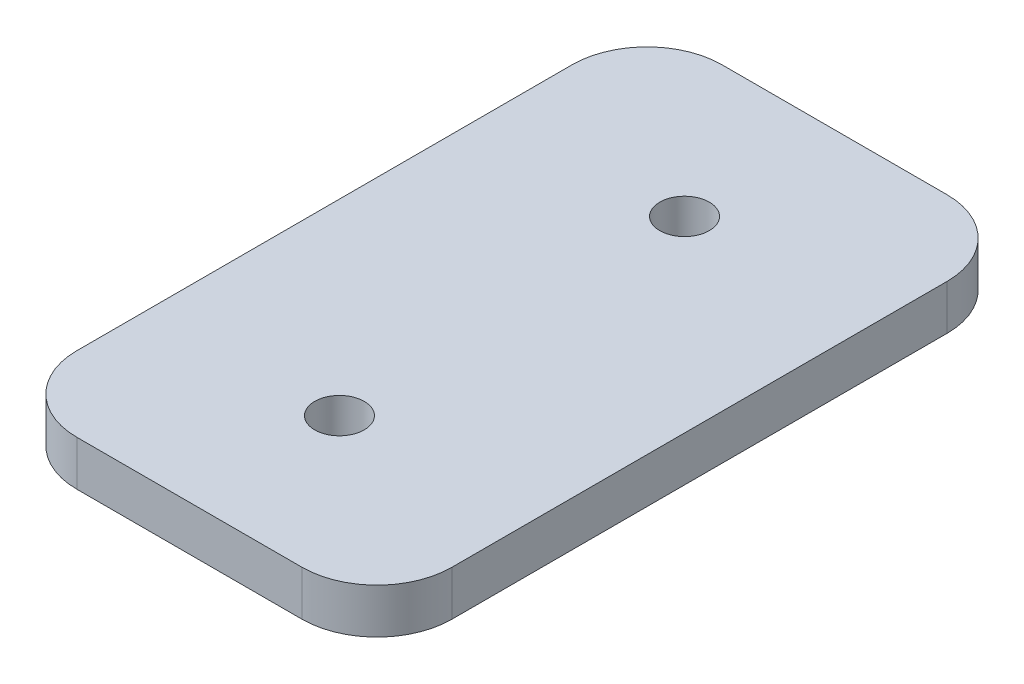
ISO-10303-21;
HEADER;
FILE_DESCRIPTION(('STEP AP214'),'2;1');
FILE_NAME('part.step','',(''),(''),'','','');
FILE_SCHEMA(('AUTOMOTIVE_DESIGN { 1 0 10303 214 1 1 1 1 }'));
ENDSEC;
DATA;
#1=APPLICATION_CONTEXT('core data for automotive mechanical design processes');
#2=APPLICATION_PROTOCOL_DEFINITION('international standard','automotive_design',2000,#1);
#3=PRODUCT_CONTEXT('',#1,'mechanical');
#4=PRODUCT('Part','Part','',(#3));
#5=PRODUCT_RELATED_PRODUCT_CATEGORY('part','',(#4));
#6=PRODUCT_DEFINITION_FORMATION('','',#4);
#7=PRODUCT_DEFINITION_CONTEXT('part definition',#1,'design');
#8=PRODUCT_DEFINITION('design','',#6,#7);
#9=PRODUCT_DEFINITION_SHAPE('','',#8);
#10=(LENGTH_UNIT() NAMED_UNIT(*) SI_UNIT(.MILLI.,.METRE.));
#11=(NAMED_UNIT(*) PLANE_ANGLE_UNIT() SI_UNIT($,.RADIAN.));
#12=(NAMED_UNIT(*) SI_UNIT($,.STERADIAN.) SOLID_ANGLE_UNIT());
#13=UNCERTAINTY_MEASURE_WITH_UNIT(LENGTH_MEASURE(1.E-05),#10,'distance_accuracy_value','');
#14=(GEOMETRIC_REPRESENTATION_CONTEXT(3) GLOBAL_UNCERTAINTY_ASSIGNED_CONTEXT((#13)) GLOBAL_UNIT_ASSIGNED_CONTEXT((#10,
#11,#12)) REPRESENTATION_CONTEXT('',''));
#15=CARTESIAN_POINT('',(0.,0.,0.));
#16=DIRECTION('',(0.,0.,1.));
#17=DIRECTION('',(1.,0.,0.));
#18=AXIS2_PLACEMENT_3D('',#15,#16,#17);
#19=CARTESIAN_POINT('',(396.231060122906,19.,-46.0000000000034));
#20=DIRECTION('',(0.,-1.,0.));
#21=DIRECTION('',(0.,0.,-1.));
#22=AXIS2_PLACEMENT_3D('',#19,#20,#21);
#23=PLANE('',#22);
#24=DIRECTION('',(1.,0.,0.));
#25=VECTOR('',#24,1.);
#26=CARTESIAN_POINT('',(0.,19.,40.0000000000028));
#27=LINE('',#26,#25);
#28=CARTESIAN_POINT('',(356.23106012291,19.,40.0000000000028));
#29=VERTEX_POINT('',#28);
#30=CARTESIAN_POINT('',(386.231060122908,19.,40.0000000000036));
#31=VERTEX_POINT('',#30);
#32=EDGE_CURVE('E118',#29,#31,#27,.T.);
#33=ORIENTED_EDGE('',*,*,#32,.F.);
#34=CARTESIAN_POINT('',(356.23106012291,19.,30.0000000000042));
#35=DIRECTION('',(0.,-1.,0.));
#36=DIRECTION('',(0.,0.,-1.));
#37=AXIS2_PLACEMENT_3D('',#34,#35,#36);
#38=CIRCLE('',#37,10.0000000000006);
#39=CARTESIAN_POINT('',(346.23106012291,19.,30.0000000000039));
#40=VERTEX_POINT('',#39);
#41=EDGE_CURVE('E98',#40,#29,#38,.F.);
#42=ORIENTED_EDGE('',*,*,#41,.F.);
#43=DIRECTION('',(0.,0.,1.));
#44=VECTOR('',#43,1.);
#45=CARTESIAN_POINT('',(346.23106012291,19.,-46.000000000003));
#46=LINE('',#45,#44);
#47=CARTESIAN_POINT('',(346.23106012291,19.,-36.0000000000022));
#48=VERTEX_POINT('',#47);
#49=EDGE_CURVE('E95',#48,#40,#46,.T.);
#50=ORIENTED_EDGE('',*,*,#49,.F.);
#51=CARTESIAN_POINT('',(356.231060122909,19.,-36.0000000000017));
#52=DIRECTION('',(0.,1.,0.));
#53=DIRECTION('',(0.,0.,1.));
#54=AXIS2_PLACEMENT_3D('',#51,#52,#53);
#55=CIRCLE('',#54,10.0000000000006);
#56=CARTESIAN_POINT('',(356.231060122909,19.,-46.0000000000025));
#57=VERTEX_POINT('',#56);
#58=EDGE_CURVE('E84',#57,#48,#55,.T.);
#59=ORIENTED_EDGE('',*,*,#58,.F.);
#60=DIRECTION('',(1.,0.,0.));
#61=VECTOR('',#60,1.);
#62=CARTESIAN_POINT('',(0.,19.,-46.0000000000027));
#63=LINE('',#62,#61);
#64=CARTESIAN_POINT('',(386.231060122907,19.,-46.0000000000028));
#65=VERTEX_POINT('',#64);
#66=EDGE_CURVE('E79',#57,#65,#63,.T.);
#67=ORIENTED_EDGE('',*,*,#66,.T.);
#68=CARTESIAN_POINT('',(386.231060122907,19.,-36.0000000000022));
#69=DIRECTION('',(0.,-1.,0.));
#70=DIRECTION('',(0.,0.,-1.));
#71=AXIS2_PLACEMENT_3D('',#68,#69,#70);
#72=CIRCLE('',#71,10.0000000000006);
#73=CARTESIAN_POINT('',(396.231060122907,19.,-36.0000000000017));
#74=VERTEX_POINT('',#73);
#75=EDGE_CURVE('E139',#74,#65,#72,.F.);
#76=ORIENTED_EDGE('',*,*,#75,.F.);
#77=DIRECTION('',(0.,0.,-1.));
#78=VECTOR('',#77,1.);
#79=CARTESIAN_POINT('',(396.231060122906,19.,-46.0000000000034));
#80=LINE('',#79,#78);
#81=CARTESIAN_POINT('',(396.231060122906,19.,30.0000000000036));
#82=VERTEX_POINT('',#81);
#83=EDGE_CURVE('E112',#82,#74,#80,.T.);
#84=ORIENTED_EDGE('',*,*,#83,.F.);
#85=CARTESIAN_POINT('',(386.231060122908,19.,30.0000000000038));
#86=DIRECTION('',(0.,1.,0.));
#87=DIRECTION('',(0.,0.,1.));
#88=AXIS2_PLACEMENT_3D('',#85,#86,#87);
#89=CIRCLE('',#88,10.0000000000006);
#90=EDGE_CURVE('E120',#31,#82,#89,.T.);
#91=ORIENTED_EDGE('',*,*,#90,.F.);
#92=EDGE_LOOP('',(#33,#42,#50,#59,#67,#76,#84,#91));
#93=FACE_BOUND('',#92,.T.);
#94=CARTESIAN_POINT('',(371.231060122909,19.,20.000000000003));
#95=DIRECTION('',(0.,-1.,0.));
#96=DIRECTION('',(1.,0.,0.));
#97=AXIS2_PLACEMENT_3D('',#94,#95,#96);
#98=CIRCLE('',#97,3.2999999999998);
#99=CARTESIAN_POINT('',(374.531060122909,19.,20.000000000003));
#100=VERTEX_POINT('',#99);
#101=EDGE_CURVE('E117',#100,#100,#98,.F.);
#102=ORIENTED_EDGE('',*,*,#101,.T.);
#103=EDGE_LOOP('',(#102));
#104=FACE_BOUND('',#103,.T.);
#105=CARTESIAN_POINT('',(371.231060122908,19.,-26.0000000000015));
#106=DIRECTION('',(0.,-1.,0.));
#107=DIRECTION('',(1.,0.,0.));
#108=AXIS2_PLACEMENT_3D('',#105,#106,#107);
#109=CIRCLE('',#108,3.2999999999998);
#110=CARTESIAN_POINT('',(374.531060122908,19.,-26.0000000000015));
#111=VERTEX_POINT('',#110);
#112=EDGE_CURVE('E20',#111,#111,#109,.F.);
#113=ORIENTED_EDGE('',*,*,#112,.T.);
#114=EDGE_LOOP('',(#113));
#115=FACE_BOUND('',#114,.T.);
#116=ADVANCED_FACE('F17',(#93,#104,#115),#23,.T.);
#117=CARTESIAN_POINT('',(371.231060122908,25.,-26.0000000000015));
#118=DIRECTION('',(0.,-1.,0.));
#119=DIRECTION('',(1.,0.,0.));
#120=AXIS2_PLACEMENT_3D('',#117,#118,#119);
#121=CYLINDRICAL_SURFACE('',#120,3.2999999999998);
#122=ORIENTED_EDGE('',*,*,#112,.F.);
#123=EDGE_LOOP('',(#122));
#124=FACE_BOUND('',#123,.T.);
#125=CARTESIAN_POINT('',(371.231060122908,25.,-26.0000000000015));
#126=DIRECTION('',(0.,-1.,0.));
#127=DIRECTION('',(1.,0.,0.));
#128=AXIS2_PLACEMENT_3D('',#125,#126,#127);
#129=CIRCLE('',#128,3.2999999999998);
#130=CARTESIAN_POINT('',(374.531060122908,25.,-26.0000000000015));
#131=VERTEX_POINT('',#130);
#132=EDGE_CURVE('E136',#131,#131,#129,.T.);
#133=ORIENTED_EDGE('',*,*,#132,.F.);
#134=EDGE_LOOP('',(#133));
#135=FACE_BOUND('',#134,.T.);
#136=ADVANCED_FACE('F151',(#124,#135),#121,.F.);
#137=CARTESIAN_POINT('',(371.231060122909,25.,20.000000000003));
#138=DIRECTION('',(0.,-1.,0.));
#139=DIRECTION('',(1.,0.,0.));
#140=AXIS2_PLACEMENT_3D('',#137,#138,#139);
#141=CYLINDRICAL_SURFACE('',#140,3.2999999999998);
#142=ORIENTED_EDGE('',*,*,#101,.F.);
#143=EDGE_LOOP('',(#142));
#144=FACE_BOUND('',#143,.T.);
#145=CARTESIAN_POINT('',(371.231060122909,25.,20.000000000003));
#146=DIRECTION('',(0.,-1.,0.));
#147=DIRECTION('',(1.,0.,0.));
#148=AXIS2_PLACEMENT_3D('',#145,#146,#147);
#149=CIRCLE('',#148,3.2999999999998);
#150=CARTESIAN_POINT('',(374.531060122909,25.,20.000000000003));
#151=VERTEX_POINT('',#150);
#152=EDGE_CURVE('E133',#151,#151,#149,.T.);
#153=ORIENTED_EDGE('',*,*,#152,.F.);
#154=EDGE_LOOP('',(#153));
#155=FACE_BOUND('',#154,.T.);
#156=ADVANCED_FACE('F154',(#144,#155),#141,.F.);
#157=CARTESIAN_POINT('',(0.,0.,-46.0000000000027));
#158=DIRECTION('',(0.,0.,1.));
#159=DIRECTION('',(1.,0.,0.));
#160=AXIS2_PLACEMENT_3D('',#157,#158,#159);
#161=PLANE('',#160);
#162=DIRECTION('',(0.,1.,0.));
#163=VECTOR('',#162,1.);
#164=CARTESIAN_POINT('',(356.231060122909,19.,-46.0000000000023));
#165=LINE('',#164,#163);
#166=CARTESIAN_POINT('',(356.231060122909,25.,-46.0000000000026));
#167=VERTEX_POINT('',#166);
#168=EDGE_CURVE('E91',#167,#57,#165,.F.);
#169=ORIENTED_EDGE('',*,*,#168,.F.);
#170=DIRECTION('',(-1.,0.,0.));
#171=VECTOR('',#170,1.);
#172=CARTESIAN_POINT('',(396.231060122906,24.9999999999999,-46.0000000000028));
#173=LINE('',#172,#171);
#174=CARTESIAN_POINT('',(386.231060122907,24.9999999999999,-46.0000000000028));
#175=VERTEX_POINT('',#174);
#176=EDGE_CURVE('E132',#175,#167,#173,.T.);
#177=ORIENTED_EDGE('',*,*,#176,.F.);
#178=DIRECTION('',(0.,-1.,0.));
#179=VECTOR('',#178,1.);
#180=CARTESIAN_POINT('',(386.231060122907,19.,-46.0000000000028));
#181=LINE('',#180,#179);
#182=EDGE_CURVE('E142',#65,#175,#181,.F.);
#183=ORIENTED_EDGE('',*,*,#182,.F.);
#184=ORIENTED_EDGE('',*,*,#66,.F.);
#185=EDGE_LOOP('',(#169,#177,#183,#184));
#186=FACE_BOUND('',#185,.T.);
#187=ADVANCED_FACE('F190',(#186),#161,.F.);
#188=CARTESIAN_POINT('',(356.231060122909,19.,-36.0000000000017));
#189=DIRECTION('',(0.,1.,0.));
#190=DIRECTION('',(0.,0.,1.));
#191=AXIS2_PLACEMENT_3D('',#188,#189,#190);
#192=CYLINDRICAL_SURFACE('',#191,10.0000000000006);
#193=ORIENTED_EDGE('',*,*,#58,.T.);
#194=DIRECTION('',(0.,1.,0.));
#195=VECTOR('',#194,1.);
#196=CARTESIAN_POINT('',(346.23106012291,19.,-36.0000000000027));
#197=LINE('',#196,#195);
#198=CARTESIAN_POINT('',(346.23106012291,25.,-36.0000000000022));
#199=VERTEX_POINT('',#198);
#200=EDGE_CURVE('E89',#199,#48,#197,.F.);
#201=ORIENTED_EDGE('',*,*,#200,.F.);
#202=CARTESIAN_POINT('',(356.231060122909,25.,-36.0000000000017));
#203=DIRECTION('',(0.,1.,0.));
#204=DIRECTION('',(0.,0.,1.));
#205=AXIS2_PLACEMENT_3D('',#202,#203,#204);
#206=CIRCLE('',#205,10.0000000000006);
#207=EDGE_CURVE('E130',#167,#199,#206,.T.);
#208=ORIENTED_EDGE('',*,*,#207,.F.);
#209=ORIENTED_EDGE('',*,*,#168,.T.);
#210=EDGE_LOOP('',(#193,#201,#208,#209));
#211=FACE_BOUND('',#210,.T.);
#212=ADVANCED_FACE('F86',(#211),#192,.T.);
#213=CARTESIAN_POINT('',(346.23106012291,19.,-46.000000000003));
#214=DIRECTION('',(-1.,0.,0.));
#215=DIRECTION('',(0.,0.,1.));
#216=AXIS2_PLACEMENT_3D('',#213,#214,#215);
#217=PLANE('',#216);
#218=ORIENTED_EDGE('',*,*,#49,.T.);
#219=DIRECTION('',(0.,-1.,0.));
#220=VECTOR('',#219,1.);
#221=CARTESIAN_POINT('',(346.23106012291,0.,30.0000000000036));
#222=LINE('',#221,#220);
#223=CARTESIAN_POINT('',(346.23106012291,25.,30.0000000000039));
#224=VERTEX_POINT('',#223);
#225=EDGE_CURVE('E101',#224,#40,#222,.T.);
#226=ORIENTED_EDGE('',*,*,#225,.F.);
#227=DIRECTION('',(0.,0.,1.));
#228=VECTOR('',#227,1.);
#229=CARTESIAN_POINT('',(346.231060122911,24.9999999999999,-46.0000000000034));
#230=LINE('',#229,#228);
#231=EDGE_CURVE('E105',#199,#224,#230,.T.);
#232=ORIENTED_EDGE('',*,*,#231,.F.);
#233=ORIENTED_EDGE('',*,*,#200,.T.);
#234=EDGE_LOOP('',(#218,#226,#232,#233));
#235=FACE_BOUND('',#234,.T.);
#236=ADVANCED_FACE('F103',(#235),#217,.T.);
#237=CARTESIAN_POINT('',(356.23106012291,0.,30.0000000000042));
#238=DIRECTION('',(0.,-1.,0.));
#239=DIRECTION('',(0.,0.,-1.));
#240=AXIS2_PLACEMENT_3D('',#237,#238,#239);
#241=CYLINDRICAL_SURFACE('',#240,10.0000000000006);
#242=ORIENTED_EDGE('',*,*,#41,.T.);
#243=DIRECTION('',(0.,1.,0.));
#244=VECTOR('',#243,1.);
#245=CARTESIAN_POINT('',(356.23106012291,0.,40.0000000000028));
#246=LINE('',#245,#244);
#247=CARTESIAN_POINT('',(356.23106012291,25.,40.0000000000036));
#248=VERTEX_POINT('',#247);
#249=EDGE_CURVE('E121',#248,#29,#246,.F.);
#250=ORIENTED_EDGE('',*,*,#249,.F.);
#251=CARTESIAN_POINT('',(356.23106012291,25.,30.0000000000042));
#252=DIRECTION('',(0.,-1.,0.));
#253=DIRECTION('',(0.,0.,-1.));
#254=AXIS2_PLACEMENT_3D('',#251,#252,#253);
#255=CIRCLE('',#254,10.0000000000006);
#256=EDGE_CURVE('E127',#224,#248,#255,.F.);
#257=ORIENTED_EDGE('',*,*,#256,.F.);
#258=ORIENTED_EDGE('',*,*,#225,.T.);
#259=EDGE_LOOP('',(#242,#250,#257,#258));
#260=FACE_BOUND('',#259,.T.);
#261=ADVANCED_FACE('F181',(#260),#241,.T.);
#262=CARTESIAN_POINT('',(0.,0.,40.0000000000028));
#263=DIRECTION('',(0.,0.,1.));
#264=DIRECTION('',(1.,0.,0.));
#265=AXIS2_PLACEMENT_3D('',#262,#263,#264);
#266=PLANE('',#265);
#267=ORIENTED_EDGE('',*,*,#32,.T.);
#268=DIRECTION('',(0.,1.,0.));
#269=VECTOR('',#268,1.);
#270=CARTESIAN_POINT('',(386.231060122908,0.,40.0000000000044));
#271=LINE('',#270,#269);
#272=CARTESIAN_POINT('',(386.231060122908,24.9999999999999,40.0000000000044));
#273=VERTEX_POINT('',#272);
#274=EDGE_CURVE('E115',#273,#31,#271,.F.);
#275=ORIENTED_EDGE('',*,*,#274,.F.);
#276=DIRECTION('',(-1.,0.,0.));
#277=VECTOR('',#276,1.);
#278=CARTESIAN_POINT('',(396.231060122906,24.9999999999999,40.0000000000044));
#279=LINE('',#278,#277);
#280=EDGE_CURVE('E126',#248,#273,#279,.F.);
#281=ORIENTED_EDGE('',*,*,#280,.F.);
#282=ORIENTED_EDGE('',*,*,#249,.T.);
#283=EDGE_LOOP('',(#267,#275,#281,#282));
#284=FACE_BOUND('',#283,.T.);
#285=ADVANCED_FACE('F177',(#284),#266,.T.);
#286=CARTESIAN_POINT('',(386.231060122908,0.,30.0000000000038));
#287=DIRECTION('',(0.,1.,0.));
#288=DIRECTION('',(0.,0.,1.));
#289=AXIS2_PLACEMENT_3D('',#286,#287,#288);
#290=CYLINDRICAL_SURFACE('',#289,10.0000000000006);
#291=CARTESIAN_POINT('',(386.231060122908,24.9999999999999,30.0000000000038));
#292=DIRECTION('',(0.,1.,0.));
#293=DIRECTION('',(0.,0.,1.));
#294=AXIS2_PLACEMENT_3D('',#291,#292,#293);
#295=CIRCLE('',#294,10.0000000000006);
#296=CARTESIAN_POINT('',(396.231060122907,24.9999999999999,30.0000000000036));
#297=VERTEX_POINT('',#296);
#298=EDGE_CURVE('E123',#273,#297,#295,.T.);
#299=ORIENTED_EDGE('',*,*,#298,.F.);
#300=ORIENTED_EDGE('',*,*,#274,.T.);
#301=ORIENTED_EDGE('',*,*,#90,.T.);
#302=DIRECTION('',(0.,1.,0.));
#303=VECTOR('',#302,1.);
#304=CARTESIAN_POINT('',(396.231060122906,19.,30.0000000000035));
#305=LINE('',#304,#303);
#306=EDGE_CURVE('E114',#297,#82,#305,.F.);
#307=ORIENTED_EDGE('',*,*,#306,.F.);
#308=EDGE_LOOP('',(#299,#300,#301,#307));
#309=FACE_BOUND('',#308,.T.);
#310=ADVANCED_FACE('F174',(#309),#290,.T.);
#311=CARTESIAN_POINT('',(396.231060122906,19.,-46.0000000000034));
#312=DIRECTION('',(1.,0.,0.));
#313=DIRECTION('',(0.,0.,-1.));
#314=AXIS2_PLACEMENT_3D('',#311,#312,#313);
#315=PLANE('',#314);
#316=DIRECTION('',(0.,0.,1.));
#317=VECTOR('',#316,1.);
#318=CARTESIAN_POINT('',(396.231060122908,24.9999999999999,-46.0000000000034));
#319=LINE('',#318,#317);
#320=CARTESIAN_POINT('',(396.231060122908,25.,-36.0000000000017));
#321=VERTEX_POINT('',#320);
#322=EDGE_CURVE('E26',#297,#321,#319,.F.);
#323=ORIENTED_EDGE('',*,*,#322,.F.);
#324=ORIENTED_EDGE('',*,*,#306,.T.);
#325=ORIENTED_EDGE('',*,*,#83,.T.);
#326=DIRECTION('',(0.,-1.,0.));
#327=VECTOR('',#326,1.);
#328=CARTESIAN_POINT('',(396.231060122908,19.,-36.0000000000011));
#329=LINE('',#328,#327);
#330=EDGE_CURVE('E35',#321,#74,#329,.T.);
#331=ORIENTED_EDGE('',*,*,#330,.F.);
#332=EDGE_LOOP('',(#323,#324,#325,#331));
#333=FACE_BOUND('',#332,.T.);
#334=ADVANCED_FACE('F166',(#333),#315,.T.);
#335=CARTESIAN_POINT('',(386.231060122907,19.,-36.0000000000022));
#336=DIRECTION('',(0.,-1.,0.));
#337=DIRECTION('',(0.,0.,-1.));
#338=AXIS2_PLACEMENT_3D('',#335,#336,#337);
#339=CYLINDRICAL_SURFACE('',#338,10.0000000000006);
#340=CARTESIAN_POINT('',(386.231060122907,25.,-36.0000000000022));
#341=DIRECTION('',(0.,-1.,0.));
#342=DIRECTION('',(0.,0.,-1.));
#343=AXIS2_PLACEMENT_3D('',#340,#341,#342);
#344=CIRCLE('',#343,10.0000000000006);
#345=EDGE_CURVE('E11',#321,#175,#344,.F.);
#346=ORIENTED_EDGE('',*,*,#345,.F.);
#347=ORIENTED_EDGE('',*,*,#330,.T.);
#348=ORIENTED_EDGE('',*,*,#75,.T.);
#349=ORIENTED_EDGE('',*,*,#182,.T.);
#350=EDGE_LOOP('',(#346,#347,#348,#349));
#351=FACE_BOUND('',#350,.T.);
#352=ADVANCED_FACE('F159',(#351),#339,.T.);
#353=CARTESIAN_POINT('',(396.231060122906,24.9999999999999,-46.0000000000034));
#354=DIRECTION('',(0.,1.,0.));
#355=DIRECTION('',(-1.,0.,0.));
#356=AXIS2_PLACEMENT_3D('',#353,#354,#355);
#357=PLANE('',#356);
#358=ORIENTED_EDGE('',*,*,#322,.T.);
#359=ORIENTED_EDGE('',*,*,#345,.T.);
#360=ORIENTED_EDGE('',*,*,#176,.T.);
#361=ORIENTED_EDGE('',*,*,#207,.T.);
#362=ORIENTED_EDGE('',*,*,#231,.T.);
#363=ORIENTED_EDGE('',*,*,#256,.T.);
#364=ORIENTED_EDGE('',*,*,#280,.T.);
#365=ORIENTED_EDGE('',*,*,#298,.T.);
#366=EDGE_LOOP('',(#358,#359,#360,#361,#362,#363,#364,#365));
#367=FACE_BOUND('',#366,.T.);
#368=ORIENTED_EDGE('',*,*,#152,.T.);
#369=EDGE_LOOP('',(#368));
#370=FACE_BOUND('',#369,.T.);
#371=ORIENTED_EDGE('',*,*,#132,.T.);
#372=EDGE_LOOP('',(#371));
#373=FACE_BOUND('',#372,.T.);
#374=ADVANCED_FACE('F157',(#367,#370,#373),#357,.T.);
#375=CLOSED_SHELL('',(#116,#136,#156,#187,#212,#236,#261,#285,#310,#334,#352,#374));
#376=MANIFOLD_SOLID_BREP('B1',#375);
#377=ADVANCED_BREP_SHAPE_REPRESENTATION('',(#18,#376),#14);
#378=SHAPE_DEFINITION_REPRESENTATION(#9,#377);
ENDSEC;
END-ISO-10303-21;
